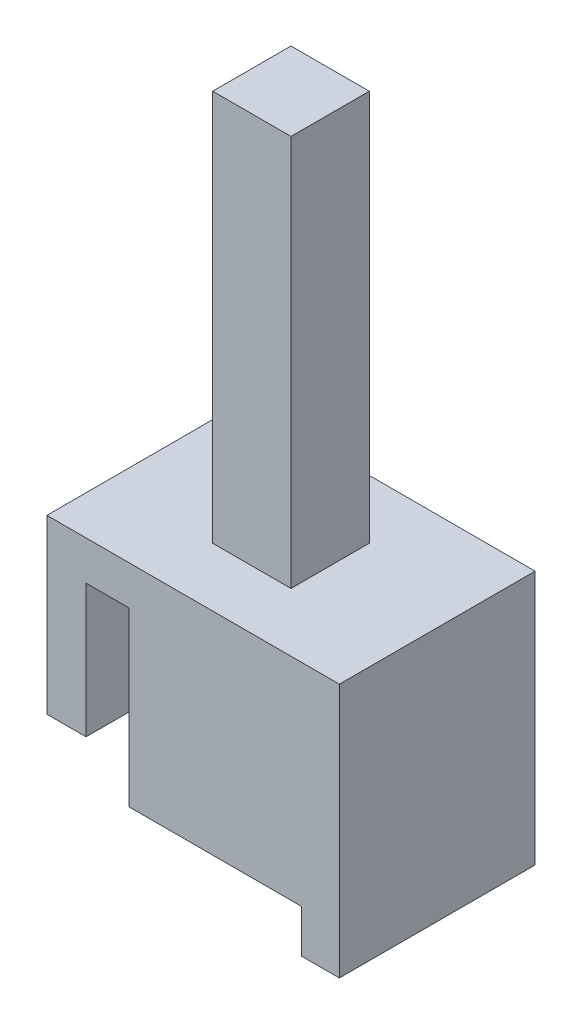
ISO-10303-21;
HEADER;
FILE_DESCRIPTION(('STEP AP214'),'2;1');
FILE_NAME('part.step','',(''),(''),'','','');
FILE_SCHEMA(('AUTOMOTIVE_DESIGN { 1 0 10303 214 1 1 1 1 }'));
ENDSEC;
DATA;
#1=APPLICATION_CONTEXT('core data for automotive mechanical design processes');
#2=APPLICATION_PROTOCOL_DEFINITION('international standard','automotive_design',2000,#1);
#3=PRODUCT_CONTEXT('',#1,'mechanical');
#4=PRODUCT('Part','Part','',(#3));
#5=PRODUCT_RELATED_PRODUCT_CATEGORY('part','',(#4));
#6=PRODUCT_DEFINITION_FORMATION('','',#4);
#7=PRODUCT_DEFINITION_CONTEXT('part definition',#1,'design');
#8=PRODUCT_DEFINITION('design','',#6,#7);
#9=PRODUCT_DEFINITION_SHAPE('','',#8);
#10=(LENGTH_UNIT() NAMED_UNIT(*) SI_UNIT(.MILLI.,.METRE.));
#11=(NAMED_UNIT(*) PLANE_ANGLE_UNIT() SI_UNIT($,.RADIAN.));
#12=(NAMED_UNIT(*) SI_UNIT($,.STERADIAN.) SOLID_ANGLE_UNIT());
#13=UNCERTAINTY_MEASURE_WITH_UNIT(LENGTH_MEASURE(1.E-05),#10,'distance_accuracy_value','');
#14=(GEOMETRIC_REPRESENTATION_CONTEXT(3) GLOBAL_UNCERTAINTY_ASSIGNED_CONTEXT((#13)) GLOBAL_UNIT_ASSIGNED_CONTEXT((#10,
#11,#12)) REPRESENTATION_CONTEXT('',''));
#15=CARTESIAN_POINT('',(0.,0.,0.));
#16=DIRECTION('',(0.,0.,1.));
#17=DIRECTION('',(1.,0.,0.));
#18=AXIS2_PLACEMENT_3D('',#15,#16,#17);
#19=CARTESIAN_POINT('',(13.641294117647,13.716,12.7));
#20=DIRECTION('',(0.,-1.,0.));
#21=DIRECTION('',(1.,0.,0.));
#22=AXIS2_PLACEMENT_3D('',#19,#20,#21);
#23=PLANE('',#22);
#24=DIRECTION('',(-1.,0.,0.));
#25=VECTOR('',#24,1.);
#26=CARTESIAN_POINT('',(13.641294117647,13.716,0.));
#27=LINE('',#26,#25);
#28=CARTESIAN_POINT('',(13.641294117647,13.716,0.));
#29=VERTEX_POINT('',#28);
#30=CARTESIAN_POINT('',(-5.334,13.716,0.));
#31=VERTEX_POINT('',#30);
#32=EDGE_CURVE('E222',#29,#31,#27,.T.);
#33=ORIENTED_EDGE('',*,*,#32,.T.);
#34=DIRECTION('',(0.,0.,-1.));
#35=VECTOR('',#34,1.);
#36=CARTESIAN_POINT('',(-5.334,13.716,12.7));
#37=LINE('',#36,#35);
#38=CARTESIAN_POINT('',(-5.334,13.716,12.7));
#39=VERTEX_POINT('',#38);
#40=EDGE_CURVE('E244',#39,#31,#37,.T.);
#41=ORIENTED_EDGE('',*,*,#40,.F.);
#42=DIRECTION('',(-1.,0.,0.));
#43=VECTOR('',#42,1.);
#44=CARTESIAN_POINT('',(13.641294117647,13.716,12.7));
#45=LINE('',#44,#43);
#46=CARTESIAN_POINT('',(13.641294117647,13.716,12.7));
#47=VERTEX_POINT('',#46);
#48=EDGE_CURVE('E195',#47,#39,#45,.T.);
#49=ORIENTED_EDGE('',*,*,#48,.F.);
#50=DIRECTION('',(0.,0.,-1.));
#51=VECTOR('',#50,1.);
#52=CARTESIAN_POINT('',(13.641294117647,13.716,12.7));
#53=LINE('',#52,#51);
#54=EDGE_CURVE('E248',#47,#29,#53,.T.);
#55=ORIENTED_EDGE('',*,*,#54,.T.);
#56=EDGE_LOOP('',(#33,#41,#49,#55));
#57=FACE_BOUND('',#56,.T.);
#58=DIRECTION('',(0.,0.,1.));
#59=VECTOR('',#58,1.);
#60=CARTESIAN_POINT('',(1.6136470588235,13.716,8.89));
#61=LINE('',#60,#59);
#62=CARTESIAN_POINT('',(1.6136470588235,13.716,3.81));
#63=VERTEX_POINT('',#62);
#64=CARTESIAN_POINT('',(1.6136470588235,13.716,8.89));
#65=VERTEX_POINT('',#64);
#66=EDGE_CURVE('E55',#63,#65,#61,.T.);
#67=ORIENTED_EDGE('',*,*,#66,.F.);
#68=DIRECTION('',(-1.,0.,0.));
#69=VECTOR('',#68,1.);
#70=CARTESIAN_POINT('',(6.6936470588235,13.716,3.81));
#71=LINE('',#70,#69);
#72=CARTESIAN_POINT('',(6.6936470588235,13.716,3.81));
#73=VERTEX_POINT('',#72);
#74=EDGE_CURVE('E59',#73,#63,#71,.T.);
#75=ORIENTED_EDGE('',*,*,#74,.F.);
#76=DIRECTION('',(0.,0.,-1.));
#77=VECTOR('',#76,1.);
#78=CARTESIAN_POINT('',(6.6936470588235,13.716,8.89));
#79=LINE('',#78,#77);
#80=CARTESIAN_POINT('',(6.6936470588235,13.716,8.89));
#81=VERTEX_POINT('',#80);
#82=EDGE_CURVE('E457',#81,#73,#79,.T.);
#83=ORIENTED_EDGE('',*,*,#82,.F.);
#84=DIRECTION('',(1.,0.,0.));
#85=VECTOR('',#84,1.);
#86=CARTESIAN_POINT('',(6.6936470588235,13.716,8.89));
#87=LINE('',#86,#85);
#88=EDGE_CURVE('E467',#65,#81,#87,.T.);
#89=ORIENTED_EDGE('',*,*,#88,.F.);
#90=EDGE_LOOP('',(#67,#75,#83,#89));
#91=FACE_BOUND('',#90,.T.);
#92=ADVANCED_FACE('F39',(#57,#91),#23,.F.);
#93=CARTESIAN_POINT('',(-2.794,11.176,12.7));
#94=DIRECTION('',(0.,1.,0.));
#95=DIRECTION('',(0.,0.,1.));
#96=AXIS2_PLACEMENT_3D('',#93,#94,#95);
#97=PLANE('',#96);
#98=DIRECTION('',(1.,0.,0.));
#99=VECTOR('',#98,1.);
#100=CARTESIAN_POINT('',(-2.794,11.176,0.));
#101=LINE('',#100,#99);
#102=CARTESIAN_POINT('',(-2.794,11.176,0.));
#103=VERTEX_POINT('',#102);
#104=CARTESIAN_POINT('',(0.,11.176,0.));
#105=VERTEX_POINT('',#104);
#106=EDGE_CURVE('E164',#103,#105,#101,.T.);
#107=ORIENTED_EDGE('',*,*,#106,.T.);
#108=DIRECTION('',(0.,0.,-1.));
#109=VECTOR('',#108,1.);
#110=CARTESIAN_POINT('',(0.,11.176,12.7));
#111=LINE('',#110,#109);
#112=CARTESIAN_POINT('',(0.,11.176,12.7));
#113=VERTEX_POINT('',#112);
#114=EDGE_CURVE('E11',#113,#105,#111,.T.);
#115=ORIENTED_EDGE('',*,*,#114,.F.);
#116=DIRECTION('',(1.,0.,0.));
#117=VECTOR('',#116,1.);
#118=CARTESIAN_POINT('',(-2.794,11.176,12.7));
#119=LINE('',#118,#117);
#120=CARTESIAN_POINT('',(-2.794,11.176,12.7));
#121=VERTEX_POINT('',#120);
#122=EDGE_CURVE('E175',#121,#113,#119,.T.);
#123=ORIENTED_EDGE('',*,*,#122,.F.);
#124=DIRECTION('',(0.,0.,-1.));
#125=VECTOR('',#124,1.);
#126=CARTESIAN_POINT('',(-2.794,11.176,12.7));
#127=LINE('',#126,#125);
#128=EDGE_CURVE('E206',#121,#103,#127,.T.);
#129=ORIENTED_EDGE('',*,*,#128,.T.);
#130=EDGE_LOOP('',(#107,#115,#123,#129));
#131=FACE_BOUND('',#130,.T.);
#132=ADVANCED_FACE('F41',(#131),#97,.F.);
#133=CARTESIAN_POINT('',(0.,11.176,12.7));
#134=DIRECTION('',(1.,0.,0.));
#135=DIRECTION('',(0.,1.,0.));
#136=AXIS2_PLACEMENT_3D('',#133,#134,#135);
#137=PLANE('',#136);
#138=DIRECTION('',(0.,-1.,0.));
#139=VECTOR('',#138,1.);
#140=CARTESIAN_POINT('',(0.,11.176,0.));
#141=LINE('',#140,#139);
#142=CARTESIAN_POINT('',(0.,0.,0.));
#143=VERTEX_POINT('',#142);
#144=EDGE_CURVE('E169',#105,#143,#141,.T.);
#145=ORIENTED_EDGE('',*,*,#144,.T.);
#146=DIRECTION('',(0.,0.,-1.));
#147=VECTOR('',#146,1.);
#148=CARTESIAN_POINT('',(0.,0.,12.7));
#149=LINE('',#148,#147);
#150=CARTESIAN_POINT('',(0.,0.,12.7));
#151=VERTEX_POINT('',#150);
#152=EDGE_CURVE('E48',#151,#143,#149,.T.);
#153=ORIENTED_EDGE('',*,*,#152,.F.);
#154=DIRECTION('',(0.,-1.,0.));
#155=VECTOR('',#154,1.);
#156=CARTESIAN_POINT('',(0.,11.176,12.7));
#157=LINE('',#156,#155);
#158=EDGE_CURVE('E179',#113,#151,#157,.T.);
#159=ORIENTED_EDGE('',*,*,#158,.F.);
#160=ORIENTED_EDGE('',*,*,#114,.T.);
#161=EDGE_LOOP('',(#145,#153,#159,#160));
#162=FACE_BOUND('',#161,.T.);
#163=ADVANCED_FACE('F292',(#162),#137,.F.);
#164=CARTESIAN_POINT('',(0.,0.,12.7));
#165=DIRECTION('',(0.,1.,0.));
#166=DIRECTION('',(0.,0.,1.));
#167=AXIS2_PLACEMENT_3D('',#164,#165,#166);
#168=PLANE('',#167);
#169=DIRECTION('',(1.,0.,0.));
#170=VECTOR('',#169,1.);
#171=CARTESIAN_POINT('',(0.,0.,0.));
#172=LINE('',#171,#170);
#173=CARTESIAN_POINT('',(11.176,0.,0.));
#174=VERTEX_POINT('',#173);
#175=EDGE_CURVE('E210',#143,#174,#172,.T.);
#176=ORIENTED_EDGE('',*,*,#175,.T.);
#177=DIRECTION('',(0.,0.,-1.));
#178=VECTOR('',#177,1.);
#179=CARTESIAN_POINT('',(11.176,0.,12.7));
#180=LINE('',#179,#178);
#181=CARTESIAN_POINT('',(11.176,0.,12.7));
#182=VERTEX_POINT('',#181);
#183=EDGE_CURVE('E260',#182,#174,#180,.T.);
#184=ORIENTED_EDGE('',*,*,#183,.F.);
#185=DIRECTION('',(1.,0.,0.));
#186=VECTOR('',#185,1.);
#187=CARTESIAN_POINT('',(0.,0.,12.7));
#188=LINE('',#187,#186);
#189=EDGE_CURVE('E183',#151,#182,#188,.T.);
#190=ORIENTED_EDGE('',*,*,#189,.F.);
#191=ORIENTED_EDGE('',*,*,#152,.T.);
#192=EDGE_LOOP('',(#176,#184,#190,#191));
#193=FACE_BOUND('',#192,.T.);
#194=ADVANCED_FACE('F269',(#193),#168,.F.);
#195=CARTESIAN_POINT('',(11.176,0.,12.7));
#196=DIRECTION('',(1.,0.,0.));
#197=DIRECTION('',(0.,1.,0.));
#198=AXIS2_PLACEMENT_3D('',#195,#196,#197);
#199=PLANE('',#198);
#200=DIRECTION('',(0.,-1.,0.));
#201=VECTOR('',#200,1.);
#202=CARTESIAN_POINT('',(11.176,0.,0.));
#203=LINE('',#202,#201);
#204=CARTESIAN_POINT('',(11.176,-2.794,0.));
#205=VERTEX_POINT('',#204);
#206=EDGE_CURVE('E213',#174,#205,#203,.T.);
#207=ORIENTED_EDGE('',*,*,#206,.T.);
#208=DIRECTION('',(0.,0.,-1.));
#209=VECTOR('',#208,1.);
#210=CARTESIAN_POINT('',(11.176,-2.794,12.7));
#211=LINE('',#210,#209);
#212=CARTESIAN_POINT('',(11.176,-2.794,12.7));
#213=VERTEX_POINT('',#212);
#214=EDGE_CURVE('E256',#213,#205,#211,.T.);
#215=ORIENTED_EDGE('',*,*,#214,.F.);
#216=DIRECTION('',(0.,-1.,0.));
#217=VECTOR('',#216,1.);
#218=CARTESIAN_POINT('',(11.176,0.,12.7));
#219=LINE('',#218,#217);
#220=EDGE_CURVE('E186',#182,#213,#219,.T.);
#221=ORIENTED_EDGE('',*,*,#220,.F.);
#222=ORIENTED_EDGE('',*,*,#183,.T.);
#223=EDGE_LOOP('',(#207,#215,#221,#222));
#224=FACE_BOUND('',#223,.T.);
#225=ADVANCED_FACE('F280',(#224),#199,.F.);
#226=CARTESIAN_POINT('',(11.176,-2.794,12.7));
#227=DIRECTION('',(0.,1.,0.));
#228=DIRECTION('',(0.,0.,1.));
#229=AXIS2_PLACEMENT_3D('',#226,#227,#228);
#230=PLANE('',#229);
#231=DIRECTION('',(1.,0.,0.));
#232=VECTOR('',#231,1.);
#233=CARTESIAN_POINT('',(11.176,-2.794,0.));
#234=LINE('',#233,#232);
#235=CARTESIAN_POINT('',(13.641294117647,-2.794,0.));
#236=VERTEX_POINT('',#235);
#237=EDGE_CURVE('E216',#205,#236,#234,.T.);
#238=ORIENTED_EDGE('',*,*,#237,.T.);
#239=DIRECTION('',(0.,0.,-1.));
#240=VECTOR('',#239,1.);
#241=CARTESIAN_POINT('',(13.641294117647,-2.794,12.7));
#242=LINE('',#241,#240);
#243=CARTESIAN_POINT('',(13.641294117647,-2.794,12.7));
#244=VERTEX_POINT('',#243);
#245=EDGE_CURVE('E252',#244,#236,#242,.T.);
#246=ORIENTED_EDGE('',*,*,#245,.F.);
#247=DIRECTION('',(1.,0.,0.));
#248=VECTOR('',#247,1.);
#249=CARTESIAN_POINT('',(11.176,-2.794,12.7));
#250=LINE('',#249,#248);
#251=EDGE_CURVE('E189',#213,#244,#250,.T.);
#252=ORIENTED_EDGE('',*,*,#251,.F.);
#253=ORIENTED_EDGE('',*,*,#214,.T.);
#254=EDGE_LOOP('',(#238,#246,#252,#253));
#255=FACE_BOUND('',#254,.T.);
#256=ADVANCED_FACE('F284',(#255),#230,.F.);
#257=CARTESIAN_POINT('',(13.641294117647,-2.794,12.7));
#258=DIRECTION('',(-1.,0.,0.));
#259=DIRECTION('',(0.,0.,1.));
#260=AXIS2_PLACEMENT_3D('',#257,#258,#259);
#261=PLANE('',#260);
#262=DIRECTION('',(0.,1.,0.));
#263=VECTOR('',#262,1.);
#264=CARTESIAN_POINT('',(13.641294117647,-2.794,0.));
#265=LINE('',#264,#263);
#266=EDGE_CURVE('E219',#236,#29,#265,.T.);
#267=ORIENTED_EDGE('',*,*,#266,.T.);
#268=ORIENTED_EDGE('',*,*,#54,.F.);
#269=DIRECTION('',(0.,1.,0.));
#270=VECTOR('',#269,1.);
#271=CARTESIAN_POINT('',(13.641294117647,-2.794,12.7));
#272=LINE('',#271,#270);
#273=EDGE_CURVE('E192',#244,#47,#272,.T.);
#274=ORIENTED_EDGE('',*,*,#273,.F.);
#275=ORIENTED_EDGE('',*,*,#245,.T.);
#276=EDGE_LOOP('',(#267,#268,#274,#275));
#277=FACE_BOUND('',#276,.T.);
#278=ADVANCED_FACE('F314',(#277),#261,.F.);
#279=CARTESIAN_POINT('',(-5.334,13.716,12.7));
#280=DIRECTION('',(1.,0.,0.));
#281=DIRECTION('',(0.,1.,0.));
#282=AXIS2_PLACEMENT_3D('',#279,#280,#281);
#283=PLANE('',#282);
#284=DIRECTION('',(0.,-1.,0.));
#285=VECTOR('',#284,1.);
#286=CARTESIAN_POINT('',(-5.334,13.716,0.));
#287=LINE('',#286,#285);
#288=CARTESIAN_POINT('',(-5.334,2.54,0.));
#289=VERTEX_POINT('',#288);
#290=EDGE_CURVE('E225',#31,#289,#287,.T.);
#291=ORIENTED_EDGE('',*,*,#290,.T.);
#292=DIRECTION('',(0.,0.,-1.));
#293=VECTOR('',#292,1.);
#294=CARTESIAN_POINT('',(-5.334,2.54,12.7));
#295=LINE('',#294,#293);
#296=CARTESIAN_POINT('',(-5.334,2.54,12.7));
#297=VERTEX_POINT('',#296);
#298=EDGE_CURVE('E240',#297,#289,#295,.T.);
#299=ORIENTED_EDGE('',*,*,#298,.F.);
#300=DIRECTION('',(0.,-1.,0.));
#301=VECTOR('',#300,1.);
#302=CARTESIAN_POINT('',(-5.334,13.716,12.7));
#303=LINE('',#302,#301);
#304=EDGE_CURVE('E198',#39,#297,#303,.T.);
#305=ORIENTED_EDGE('',*,*,#304,.F.);
#306=ORIENTED_EDGE('',*,*,#40,.T.);
#307=EDGE_LOOP('',(#291,#299,#305,#306));
#308=FACE_BOUND('',#307,.T.);
#309=ADVANCED_FACE('F308',(#308),#283,.F.);
#310=CARTESIAN_POINT('',(-5.334,2.54,12.7));
#311=DIRECTION('',(0.,1.,0.));
#312=DIRECTION('',(0.,0.,1.));
#313=AXIS2_PLACEMENT_3D('',#310,#311,#312);
#314=PLANE('',#313);
#315=DIRECTION('',(1.,0.,0.));
#316=VECTOR('',#315,1.);
#317=CARTESIAN_POINT('',(-5.334,2.54,0.));
#318=LINE('',#317,#316);
#319=CARTESIAN_POINT('',(-2.794,2.54,0.));
#320=VERTEX_POINT('',#319);
#321=EDGE_CURVE('E228',#289,#320,#318,.T.);
#322=ORIENTED_EDGE('',*,*,#321,.T.);
#323=DIRECTION('',(0.,0.,-1.));
#324=VECTOR('',#323,1.);
#325=CARTESIAN_POINT('',(-2.794,2.54,12.7));
#326=LINE('',#325,#324);
#327=CARTESIAN_POINT('',(-2.794,2.54,12.7));
#328=VERTEX_POINT('',#327);
#329=EDGE_CURVE('E236',#328,#320,#326,.T.);
#330=ORIENTED_EDGE('',*,*,#329,.F.);
#331=DIRECTION('',(1.,0.,0.));
#332=VECTOR('',#331,1.);
#333=CARTESIAN_POINT('',(-5.334,2.54,12.7));
#334=LINE('',#333,#332);
#335=EDGE_CURVE('E201',#297,#328,#334,.T.);
#336=ORIENTED_EDGE('',*,*,#335,.F.);
#337=ORIENTED_EDGE('',*,*,#298,.T.);
#338=EDGE_LOOP('',(#322,#330,#336,#337));
#339=FACE_BOUND('',#338,.T.);
#340=ADVANCED_FACE('F304',(#339),#314,.F.);
#341=CARTESIAN_POINT('',(-2.794,2.54,12.7));
#342=DIRECTION('',(-1.,0.,0.));
#343=DIRECTION('',(0.,-1.,0.));
#344=AXIS2_PLACEMENT_3D('',#341,#342,#343);
#345=PLANE('',#344);
#346=DIRECTION('',(0.,1.,0.));
#347=VECTOR('',#346,1.);
#348=CARTESIAN_POINT('',(-2.794,2.54,0.));
#349=LINE('',#348,#347);
#350=EDGE_CURVE('E180',#320,#103,#349,.T.);
#351=ORIENTED_EDGE('',*,*,#350,.T.);
#352=ORIENTED_EDGE('',*,*,#128,.F.);
#353=DIRECTION('',(0.,1.,0.));
#354=VECTOR('',#353,1.);
#355=CARTESIAN_POINT('',(-2.794,2.54,12.7));
#356=LINE('',#355,#354);
#357=EDGE_CURVE('E204',#328,#121,#356,.T.);
#358=ORIENTED_EDGE('',*,*,#357,.F.);
#359=ORIENTED_EDGE('',*,*,#329,.T.);
#360=EDGE_LOOP('',(#351,#352,#358,#359));
#361=FACE_BOUND('',#360,.T.);
#362=ADVANCED_FACE('F299',(#361),#345,.F.);
#363=CARTESIAN_POINT('',(0.,0.,12.7));
#364=DIRECTION('',(0.,0.,-1.));
#365=DIRECTION('',(-1.,0.,0.));
#366=AXIS2_PLACEMENT_3D('',#363,#364,#365);
#367=PLANE('',#366);
#368=ORIENTED_EDGE('',*,*,#122,.T.);
#369=ORIENTED_EDGE('',*,*,#158,.T.);
#370=ORIENTED_EDGE('',*,*,#189,.T.);
#371=ORIENTED_EDGE('',*,*,#220,.T.);
#372=ORIENTED_EDGE('',*,*,#251,.T.);
#373=ORIENTED_EDGE('',*,*,#273,.T.);
#374=ORIENTED_EDGE('',*,*,#48,.T.);
#375=ORIENTED_EDGE('',*,*,#304,.T.);
#376=ORIENTED_EDGE('',*,*,#335,.T.);
#377=ORIENTED_EDGE('',*,*,#357,.T.);
#378=EDGE_LOOP('',(#368,#369,#370,#371,#372,#373,#374,#375,#376,#377));
#379=FACE_BOUND('',#378,.T.);
#380=ADVANCED_FACE('F288',(#379),#367,.F.);
#381=CARTESIAN_POINT('',(0.,0.,0.));
#382=DIRECTION('',(0.,0.,-1.));
#383=DIRECTION('',(-1.,0.,0.));
#384=AXIS2_PLACEMENT_3D('',#381,#382,#383);
#385=PLANE('',#384);
#386=ORIENTED_EDGE('',*,*,#106,.F.);
#387=ORIENTED_EDGE('',*,*,#350,.F.);
#388=ORIENTED_EDGE('',*,*,#321,.F.);
#389=ORIENTED_EDGE('',*,*,#290,.F.);
#390=ORIENTED_EDGE('',*,*,#32,.F.);
#391=ORIENTED_EDGE('',*,*,#266,.F.);
#392=ORIENTED_EDGE('',*,*,#237,.F.);
#393=ORIENTED_EDGE('',*,*,#206,.F.);
#394=ORIENTED_EDGE('',*,*,#175,.F.);
#395=ORIENTED_EDGE('',*,*,#144,.F.);
#396=EDGE_LOOP('',(#386,#387,#388,#389,#390,#391,#392,#393,#394,#395));
#397=FACE_BOUND('',#396,.T.);
#398=ADVANCED_FACE('F275',(#397),#385,.T.);
#399=CARTESIAN_POINT('',(1.6136470588235,39.116,8.89));
#400=DIRECTION('',(1.,0.,0.));
#401=DIRECTION('',(0.,1.,0.));
#402=AXIS2_PLACEMENT_3D('',#399,#400,#401);
#403=PLANE('',#402);
#404=ORIENTED_EDGE('',*,*,#66,.T.);
#405=DIRECTION('',(0.,-1.,0.));
#406=VECTOR('',#405,1.);
#407=CARTESIAN_POINT('',(1.6136470588235,39.116,8.89));
#408=LINE('',#407,#406);
#409=CARTESIAN_POINT('',(1.6136470588235,39.116,8.89));
#410=VERTEX_POINT('',#409);
#411=EDGE_CURVE('E144',#410,#65,#408,.T.);
#412=ORIENTED_EDGE('',*,*,#411,.F.);
#413=DIRECTION('',(0.,0.,1.));
#414=VECTOR('',#413,1.);
#415=CARTESIAN_POINT('',(1.6136470588235,39.116,8.89));
#416=LINE('',#415,#414);
#417=CARTESIAN_POINT('',(1.6136470588235,39.116,3.81));
#418=VERTEX_POINT('',#417);
#419=EDGE_CURVE('E151',#418,#410,#416,.T.);
#420=ORIENTED_EDGE('',*,*,#419,.F.);
#421=DIRECTION('',(0.,-1.,0.));
#422=VECTOR('',#421,1.);
#423=CARTESIAN_POINT('',(1.6136470588235,39.116,3.81));
#424=LINE('',#423,#422);
#425=EDGE_CURVE('E454',#418,#63,#424,.T.);
#426=ORIENTED_EDGE('',*,*,#425,.T.);
#427=EDGE_LOOP('',(#404,#412,#420,#426));
#428=FACE_BOUND('',#427,.T.);
#429=ADVANCED_FACE('F162',(#428),#403,.F.);
#430=CARTESIAN_POINT('',(6.6936470588235,39.116,8.89));
#431=DIRECTION('',(0.,0.,-1.));
#432=DIRECTION('',(-1.,0.,0.));
#433=AXIS2_PLACEMENT_3D('',#430,#431,#432);
#434=PLANE('',#433);
#435=ORIENTED_EDGE('',*,*,#88,.T.);
#436=DIRECTION('',(0.,-1.,0.));
#437=VECTOR('',#436,1.);
#438=CARTESIAN_POINT('',(6.6936470588235,39.116,8.89));
#439=LINE('',#438,#437);
#440=CARTESIAN_POINT('',(6.6936470588235,39.116,8.89));
#441=VERTEX_POINT('',#440);
#442=EDGE_CURVE('E146',#441,#81,#439,.T.);
#443=ORIENTED_EDGE('',*,*,#442,.F.);
#444=DIRECTION('',(1.,0.,0.));
#445=VECTOR('',#444,1.);
#446=CARTESIAN_POINT('',(6.6936470588235,39.116,8.89));
#447=LINE('',#446,#445);
#448=EDGE_CURVE('E139',#410,#441,#447,.T.);
#449=ORIENTED_EDGE('',*,*,#448,.F.);
#450=ORIENTED_EDGE('',*,*,#411,.T.);
#451=EDGE_LOOP('',(#435,#443,#449,#450));
#452=FACE_BOUND('',#451,.T.);
#453=ADVANCED_FACE('F142',(#452),#434,.F.);
#454=CARTESIAN_POINT('',(6.6936470588235,39.116,8.89));
#455=DIRECTION('',(-1.,0.,0.));
#456=DIRECTION('',(0.,-1.,0.));
#457=AXIS2_PLACEMENT_3D('',#454,#455,#456);
#458=PLANE('',#457);
#459=ORIENTED_EDGE('',*,*,#82,.T.);
#460=DIRECTION('',(0.,-1.,0.));
#461=VECTOR('',#460,1.);
#462=CARTESIAN_POINT('',(6.6936470588235,39.116,3.81));
#463=LINE('',#462,#461);
#464=CARTESIAN_POINT('',(6.6936470588235,39.116,3.81));
#465=VERTEX_POINT('',#464);
#466=EDGE_CURVE('E171',#465,#73,#463,.T.);
#467=ORIENTED_EDGE('',*,*,#466,.F.);
#468=DIRECTION('',(0.,0.,-1.));
#469=VECTOR('',#468,1.);
#470=CARTESIAN_POINT('',(6.6936470588235,39.116,8.89));
#471=LINE('',#470,#469);
#472=EDGE_CURVE('E150',#441,#465,#471,.T.);
#473=ORIENTED_EDGE('',*,*,#472,.F.);
#474=ORIENTED_EDGE('',*,*,#442,.T.);
#475=EDGE_LOOP('',(#459,#467,#473,#474));
#476=FACE_BOUND('',#475,.T.);
#477=ADVANCED_FACE('F341',(#476),#458,.F.);
#478=CARTESIAN_POINT('',(6.6936470588235,39.116,3.81));
#479=DIRECTION('',(0.,0.,1.));
#480=DIRECTION('',(1.,0.,0.));
#481=AXIS2_PLACEMENT_3D('',#478,#479,#480);
#482=PLANE('',#481);
#483=ORIENTED_EDGE('',*,*,#74,.T.);
#484=ORIENTED_EDGE('',*,*,#425,.F.);
#485=DIRECTION('',(-1.,0.,0.));
#486=VECTOR('',#485,1.);
#487=CARTESIAN_POINT('',(6.6936470588235,39.116,3.81));
#488=LINE('',#487,#486);
#489=EDGE_CURVE('E156',#465,#418,#488,.T.);
#490=ORIENTED_EDGE('',*,*,#489,.F.);
#491=ORIENTED_EDGE('',*,*,#466,.T.);
#492=EDGE_LOOP('',(#483,#484,#490,#491));
#493=FACE_BOUND('',#492,.T.);
#494=ADVANCED_FACE('F344',(#493),#482,.F.);
#495=CARTESIAN_POINT('',(0.,39.116,0.));
#496=DIRECTION('',(0.,1.,0.));
#497=DIRECTION('',(0.,0.,1.));
#498=AXIS2_PLACEMENT_3D('',#495,#496,#497);
#499=PLANE('',#498);
#500=ORIENTED_EDGE('',*,*,#419,.T.);
#501=ORIENTED_EDGE('',*,*,#448,.T.);
#502=ORIENTED_EDGE('',*,*,#472,.T.);
#503=ORIENTED_EDGE('',*,*,#489,.T.);
#504=EDGE_LOOP('',(#500,#501,#502,#503));
#505=FACE_BOUND('',#504,.T.);
#506=ADVANCED_FACE('F154',(#505),#499,.T.);
#507=CLOSED_SHELL('',(#92,#132,#163,#194,#225,#256,#278,#309,#340,#362,#380,#398,#429,#453,#477,
#494,#506));
#508=MANIFOLD_SOLID_BREP('B2',#507);
#509=ADVANCED_BREP_SHAPE_REPRESENTATION('',(#18,#508),#14);
#510=SHAPE_DEFINITION_REPRESENTATION(#9,#509);
ENDSEC;
END-ISO-10303-21;
